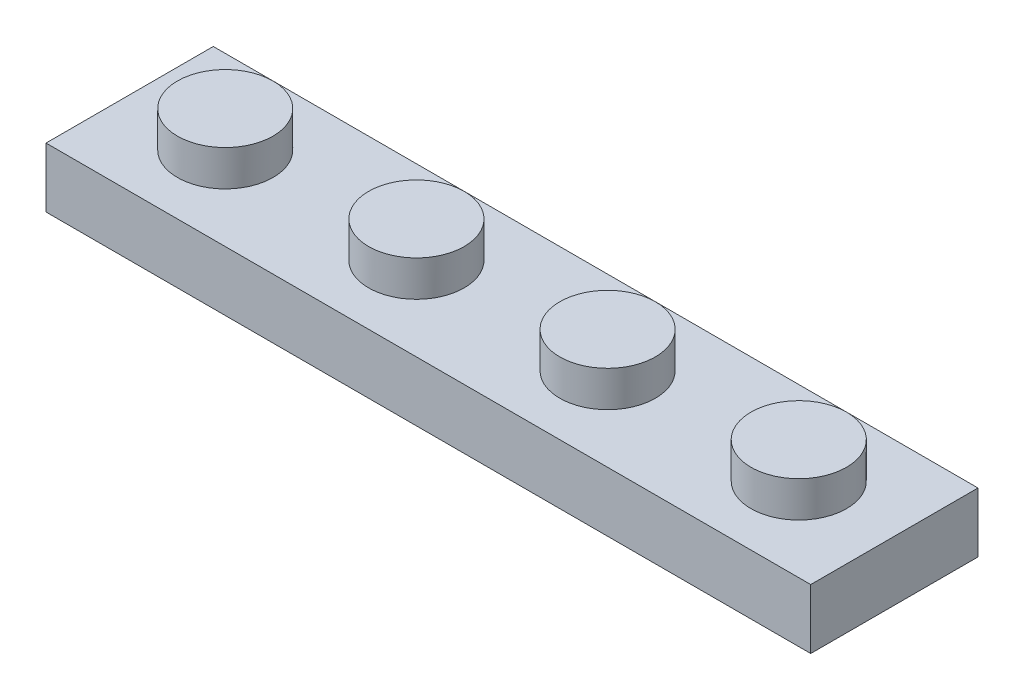
ISO-10303-21;
HEADER;
FILE_DESCRIPTION(('STEP AP214'),'2;1');
FILE_NAME('part.step','',(''),(''),'','','');
FILE_SCHEMA(('AUTOMOTIVE_DESIGN { 1 0 10303 214 1 1 1 1 }'));
ENDSEC;
DATA;
#1=APPLICATION_CONTEXT('core data for automotive mechanical design processes');
#2=APPLICATION_PROTOCOL_DEFINITION('international standard','automotive_design',2000,#1);
#3=PRODUCT_CONTEXT('',#1,'mechanical');
#4=PRODUCT('Part','Part','',(#3));
#5=PRODUCT_RELATED_PRODUCT_CATEGORY('part','',(#4));
#6=PRODUCT_DEFINITION_FORMATION('','',#4);
#7=PRODUCT_DEFINITION_CONTEXT('part definition',#1,'design');
#8=PRODUCT_DEFINITION('design','',#6,#7);
#9=PRODUCT_DEFINITION_SHAPE('','',#8);
#10=(LENGTH_UNIT() NAMED_UNIT(*) SI_UNIT(.MILLI.,.METRE.));
#11=(NAMED_UNIT(*) PLANE_ANGLE_UNIT() SI_UNIT($,.RADIAN.));
#12=(NAMED_UNIT(*) SI_UNIT($,.STERADIAN.) SOLID_ANGLE_UNIT());
#13=UNCERTAINTY_MEASURE_WITH_UNIT(LENGTH_MEASURE(1.E-05),#10,'distance_accuracy_value','');
#14=(GEOMETRIC_REPRESENTATION_CONTEXT(3) GLOBAL_UNCERTAINTY_ASSIGNED_CONTEXT((#13)) GLOBAL_UNIT_ASSIGNED_CONTEXT((#10,
#11,#12)) REPRESENTATION_CONTEXT('',''));
#15=CARTESIAN_POINT('',(0.,0.,0.));
#16=DIRECTION('',(0.,0.,1.));
#17=DIRECTION('',(1.,0.,0.));
#18=AXIS2_PLACEMENT_3D('',#15,#16,#17);
#19=CARTESIAN_POINT('',(-20.32,-3.175,4.445));
#20=DIRECTION('',(1.,0.,0.));
#21=DIRECTION('',(0.,0.,-1.));
#22=AXIS2_PLACEMENT_3D('',#19,#20,#21);
#23=PLANE('',#22);
#24=DIRECTION('',(0.,-1.,0.));
#25=VECTOR('',#24,1.);
#26=CARTESIAN_POINT('',(-20.32,-3.175,-4.445));
#27=LINE('',#26,#25);
#28=CARTESIAN_POINT('',(-20.32,0.,-4.445));
#29=VERTEX_POINT('',#28);
#30=CARTESIAN_POINT('',(-20.32,-3.175,-4.445));
#31=VERTEX_POINT('',#30);
#32=EDGE_CURVE('E163',#29,#31,#27,.T.);
#33=ORIENTED_EDGE('',*,*,#32,.T.);
#34=DIRECTION('',(0.,0.,-1.));
#35=VECTOR('',#34,1.);
#36=CARTESIAN_POINT('',(-20.32,-3.175,4.445));
#37=LINE('',#36,#35);
#38=CARTESIAN_POINT('',(-20.32,-3.175,4.445));
#39=VERTEX_POINT('',#38);
#40=EDGE_CURVE('E184',#39,#31,#37,.T.);
#41=ORIENTED_EDGE('',*,*,#40,.F.);
#42=DIRECTION('',(0.,-1.,0.));
#43=VECTOR('',#42,1.);
#44=CARTESIAN_POINT('',(-20.32,-3.175,4.445));
#45=LINE('',#44,#43);
#46=CARTESIAN_POINT('',(-20.32,0.,4.445));
#47=VERTEX_POINT('',#46);
#48=EDGE_CURVE('E164',#47,#39,#45,.T.);
#49=ORIENTED_EDGE('',*,*,#48,.F.);
#50=DIRECTION('',(0.,0.,-1.));
#51=VECTOR('',#50,1.);
#52=CARTESIAN_POINT('',(-20.32,0.,4.445));
#53=LINE('',#52,#51);
#54=EDGE_CURVE('E170',#47,#29,#53,.T.);
#55=ORIENTED_EDGE('',*,*,#54,.T.);
#56=EDGE_LOOP('',(#33,#41,#49,#55));
#57=FACE_BOUND('',#56,.T.);
#58=ADVANCED_FACE('F35',(#57),#23,.F.);
#59=CARTESIAN_POINT('',(20.32,-3.175,4.445));
#60=DIRECTION('',(0.,1.,0.));
#61=DIRECTION('',(0.,0.,1.));
#62=AXIS2_PLACEMENT_3D('',#59,#60,#61);
#63=PLANE('',#62);
#64=DIRECTION('',(0.,0.,-1.));
#65=VECTOR('',#64,1.);
#66=CARTESIAN_POINT('',(-19.05,-3.175,2.54));
#67=LINE('',#66,#65);
#68=CARTESIAN_POINT('',(-19.05,-3.175,2.54));
#69=VERTEX_POINT('',#68);
#70=CARTESIAN_POINT('',(-19.05,-3.175,-2.54));
#71=VERTEX_POINT('',#70);
#72=EDGE_CURVE('E141',#69,#71,#67,.T.);
#73=ORIENTED_EDGE('',*,*,#72,.F.);
#74=DIRECTION('',(-1.,0.,0.));
#75=VECTOR('',#74,1.);
#76=CARTESIAN_POINT('',(19.05,-3.175,2.54));
#77=LINE('',#76,#75);
#78=CARTESIAN_POINT('',(19.05,-3.175,2.54));
#79=VERTEX_POINT('',#78);
#80=EDGE_CURVE('E49',#79,#69,#77,.T.);
#81=ORIENTED_EDGE('',*,*,#80,.F.);
#82=DIRECTION('',(0.,0.,1.));
#83=VECTOR('',#82,1.);
#84=CARTESIAN_POINT('',(19.05,-3.175,-2.54));
#85=LINE('',#84,#83);
#86=CARTESIAN_POINT('',(19.05,-3.175,-2.54));
#87=VERTEX_POINT('',#86);
#88=EDGE_CURVE('E129',#87,#79,#85,.T.);
#89=ORIENTED_EDGE('',*,*,#88,.F.);
#90=DIRECTION('',(1.,0.,0.));
#91=VECTOR('',#90,1.);
#92=CARTESIAN_POINT('',(-19.05,-3.175,-2.54));
#93=LINE('',#92,#91);
#94=EDGE_CURVE('E132',#71,#87,#93,.T.);
#95=ORIENTED_EDGE('',*,*,#94,.F.);
#96=EDGE_LOOP('',(#73,#81,#89,#95));
#97=FACE_BOUND('',#96,.T.);
#98=DIRECTION('',(1.,0.,0.));
#99=VECTOR('',#98,1.);
#100=CARTESIAN_POINT('',(20.32,-3.175,-4.445));
#101=LINE('',#100,#99);
#102=CARTESIAN_POINT('',(20.32,-3.175,-4.445));
#103=VERTEX_POINT('',#102);
#104=EDGE_CURVE('E173',#31,#103,#101,.T.);
#105=ORIENTED_EDGE('',*,*,#104,.T.);
#106=DIRECTION('',(0.,0.,-1.));
#107=VECTOR('',#106,1.);
#108=CARTESIAN_POINT('',(20.32,-3.175,4.445));
#109=LINE('',#108,#107);
#110=CARTESIAN_POINT('',(20.32,-3.175,4.445));
#111=VERTEX_POINT('',#110);
#112=EDGE_CURVE('E181',#111,#103,#109,.T.);
#113=ORIENTED_EDGE('',*,*,#112,.F.);
#114=DIRECTION('',(1.,0.,0.));
#115=VECTOR('',#114,1.);
#116=CARTESIAN_POINT('',(20.32,-3.175,4.445));
#117=LINE('',#116,#115);
#118=EDGE_CURVE('E87',#39,#111,#117,.T.);
#119=ORIENTED_EDGE('',*,*,#118,.F.);
#120=ORIENTED_EDGE('',*,*,#40,.T.);
#121=EDGE_LOOP('',(#105,#113,#119,#120));
#122=FACE_BOUND('',#121,.T.);
#123=ADVANCED_FACE('F231',(#97,#122),#63,.F.);
#124=CARTESIAN_POINT('',(20.32,0.,4.445));
#125=DIRECTION('',(-1.,0.,0.));
#126=DIRECTION('',(0.,0.,1.));
#127=AXIS2_PLACEMENT_3D('',#124,#125,#126);
#128=PLANE('',#127);
#129=DIRECTION('',(0.,1.,0.));
#130=VECTOR('',#129,1.);
#131=CARTESIAN_POINT('',(20.32,0.,-4.445));
#132=LINE('',#131,#130);
#133=CARTESIAN_POINT('',(20.32,0.,-4.445));
#134=VERTEX_POINT('',#133);
#135=EDGE_CURVE('E175',#103,#134,#132,.T.);
#136=ORIENTED_EDGE('',*,*,#135,.T.);
#137=DIRECTION('',(0.,0.,-1.));
#138=VECTOR('',#137,1.);
#139=CARTESIAN_POINT('',(20.32,0.,4.445));
#140=LINE('',#139,#138);
#141=CARTESIAN_POINT('',(20.32,0.,4.445));
#142=VERTEX_POINT('',#141);
#143=EDGE_CURVE('E179',#142,#134,#140,.T.);
#144=ORIENTED_EDGE('',*,*,#143,.F.);
#145=DIRECTION('',(0.,1.,0.));
#146=VECTOR('',#145,1.);
#147=CARTESIAN_POINT('',(20.32,0.,4.445));
#148=LINE('',#147,#146);
#149=EDGE_CURVE('E167',#111,#142,#148,.T.);
#150=ORIENTED_EDGE('',*,*,#149,.F.);
#151=ORIENTED_EDGE('',*,*,#112,.T.);
#152=EDGE_LOOP('',(#136,#144,#150,#151));
#153=FACE_BOUND('',#152,.T.);
#154=ADVANCED_FACE('F236',(#153),#128,.F.);
#155=CARTESIAN_POINT('',(-20.32,0.,4.445));
#156=DIRECTION('',(0.,-1.,0.));
#157=DIRECTION('',(0.,0.,-1.));
#158=AXIS2_PLACEMENT_3D('',#155,#156,#157);
#159=PLANE('',#158);
#160=CARTESIAN_POINT('',(15.24,0.,0.));
#161=DIRECTION('',(0.,-1.,0.));
#162=DIRECTION('',(0.,0.,-1.));
#163=AXIS2_PLACEMENT_3D('',#160,#161,#162);
#164=CIRCLE('',#163,2.54);
#165=CARTESIAN_POINT('',(15.24,0.,-2.54));
#166=VERTEX_POINT('',#165);
#167=EDGE_CURVE('E195',#166,#166,#164,.F.);
#168=ORIENTED_EDGE('',*,*,#167,.F.);
#169=EDGE_LOOP('',(#168));
#170=FACE_BOUND('',#169,.T.);
#171=CARTESIAN_POINT('',(5.08,0.,0.));
#172=DIRECTION('',(0.,-1.,0.));
#173=DIRECTION('',(0.,0.,-1.));
#174=AXIS2_PLACEMENT_3D('',#171,#172,#173);
#175=CIRCLE('',#174,2.54);
#176=CARTESIAN_POINT('',(5.08,0.,-2.54));
#177=VERTEX_POINT('',#176);
#178=EDGE_CURVE('E192',#177,#177,#175,.F.);
#179=ORIENTED_EDGE('',*,*,#178,.F.);
#180=EDGE_LOOP('',(#179));
#181=FACE_BOUND('',#180,.T.);
#182=CARTESIAN_POINT('',(-5.08,0.,0.));
#183=DIRECTION('',(0.,-1.,0.));
#184=DIRECTION('',(0.,0.,-1.));
#185=AXIS2_PLACEMENT_3D('',#182,#183,#184);
#186=CIRCLE('',#185,2.54);
#187=CARTESIAN_POINT('',(-5.08,0.,-2.54));
#188=VERTEX_POINT('',#187);
#189=EDGE_CURVE('E189',#188,#188,#186,.F.);
#190=ORIENTED_EDGE('',*,*,#189,.F.);
#191=EDGE_LOOP('',(#190));
#192=FACE_BOUND('',#191,.T.);
#193=CARTESIAN_POINT('',(-15.24,0.,0.));
#194=DIRECTION('',(0.,-1.,0.));
#195=DIRECTION('',(0.,0.,-1.));
#196=AXIS2_PLACEMENT_3D('',#193,#194,#195);
#197=CIRCLE('',#196,2.54);
#198=CARTESIAN_POINT('',(-15.24,0.,-2.54));
#199=VERTEX_POINT('',#198);
#200=EDGE_CURVE('E186',#199,#199,#197,.F.);
#201=ORIENTED_EDGE('',*,*,#200,.F.);
#202=EDGE_LOOP('',(#201));
#203=FACE_BOUND('',#202,.T.);
#204=DIRECTION('',(-1.,0.,0.));
#205=VECTOR('',#204,1.);
#206=CARTESIAN_POINT('',(-20.32,0.,-4.445));
#207=LINE('',#206,#205);
#208=EDGE_CURVE('E79',#134,#29,#207,.T.);
#209=ORIENTED_EDGE('',*,*,#208,.T.);
#210=ORIENTED_EDGE('',*,*,#54,.F.);
#211=DIRECTION('',(-1.,0.,0.));
#212=VECTOR('',#211,1.);
#213=CARTESIAN_POINT('',(-20.32,0.,4.445));
#214=LINE('',#213,#212);
#215=EDGE_CURVE('E58',#142,#47,#214,.T.);
#216=ORIENTED_EDGE('',*,*,#215,.F.);
#217=ORIENTED_EDGE('',*,*,#143,.T.);
#218=EDGE_LOOP('',(#209,#210,#216,#217));
#219=FACE_BOUND('',#218,.T.);
#220=ADVANCED_FACE('F249',(#170,#181,#192,#203,#219),#159,.F.);
#221=CARTESIAN_POINT('',(0.,0.,4.445));
#222=DIRECTION('',(0.,0.,-1.));
#223=DIRECTION('',(-1.,0.,0.));
#224=AXIS2_PLACEMENT_3D('',#221,#222,#223);
#225=PLANE('',#224);
#226=ORIENTED_EDGE('',*,*,#48,.T.);
#227=ORIENTED_EDGE('',*,*,#118,.T.);
#228=ORIENTED_EDGE('',*,*,#149,.T.);
#229=ORIENTED_EDGE('',*,*,#215,.T.);
#230=EDGE_LOOP('',(#226,#227,#228,#229));
#231=FACE_BOUND('',#230,.T.);
#232=ADVANCED_FACE('F247',(#231),#225,.F.);
#233=CARTESIAN_POINT('',(0.,0.,-4.445));
#234=DIRECTION('',(0.,0.,-1.));
#235=DIRECTION('',(-1.,0.,0.));
#236=AXIS2_PLACEMENT_3D('',#233,#234,#235);
#237=PLANE('',#236);
#238=ORIENTED_EDGE('',*,*,#32,.F.);
#239=ORIENTED_EDGE('',*,*,#208,.F.);
#240=ORIENTED_EDGE('',*,*,#135,.F.);
#241=ORIENTED_EDGE('',*,*,#104,.F.);
#242=EDGE_LOOP('',(#238,#239,#240,#241));
#243=FACE_BOUND('',#242,.T.);
#244=ADVANCED_FACE('F242',(#243),#237,.T.);
#245=CARTESIAN_POINT('',(-15.24,1.905,0.));
#246=DIRECTION('',(0.,-1.,0.));
#247=DIRECTION('',(0.,0.,-1.));
#248=AXIS2_PLACEMENT_3D('',#245,#246,#247);
#249=CYLINDRICAL_SURFACE('',#248,2.54);
#250=CARTESIAN_POINT('',(-15.24,1.905,0.));
#251=DIRECTION('',(0.,1.,0.));
#252=DIRECTION('',(0.,0.,1.));
#253=AXIS2_PLACEMENT_3D('',#250,#251,#252);
#254=CIRCLE('',#253,2.54);
#255=CARTESIAN_POINT('',(-15.24,1.905,2.54));
#256=VERTEX_POINT('',#255);
#257=EDGE_CURVE('E160',#256,#256,#254,.T.);
#258=ORIENTED_EDGE('',*,*,#257,.F.);
#259=EDGE_LOOP('',(#258));
#260=FACE_BOUND('',#259,.T.);
#261=ORIENTED_EDGE('',*,*,#200,.T.);
#262=EDGE_LOOP('',(#261));
#263=FACE_BOUND('',#262,.T.);
#264=ADVANCED_FACE('F255',(#260,#263),#249,.T.);
#265=CARTESIAN_POINT('',(-15.24,1.905,0.));
#266=DIRECTION('',(0.,1.,0.));
#267=DIRECTION('',(0.,0.,1.));
#268=AXIS2_PLACEMENT_3D('',#265,#266,#267);
#269=PLANE('',#268);
#270=ORIENTED_EDGE('',*,*,#257,.T.);
#271=EDGE_LOOP('',(#270));
#272=FACE_BOUND('',#271,.T.);
#273=ADVANCED_FACE('F284',(#272),#269,.T.);
#274=CARTESIAN_POINT('',(-5.08,1.905,0.));
#275=DIRECTION('',(0.,-1.,0.));
#276=DIRECTION('',(0.,0.,-1.));
#277=AXIS2_PLACEMENT_3D('',#274,#275,#276);
#278=CYLINDRICAL_SURFACE('',#277,2.54);
#279=CARTESIAN_POINT('',(-5.08,1.905,0.));
#280=DIRECTION('',(0.,1.,0.));
#281=DIRECTION('',(0.,0.,1.));
#282=AXIS2_PLACEMENT_3D('',#279,#280,#281);
#283=CIRCLE('',#282,2.54);
#284=CARTESIAN_POINT('',(-5.08,1.905,2.54));
#285=VERTEX_POINT('',#284);
#286=EDGE_CURVE('E157',#285,#285,#283,.T.);
#287=ORIENTED_EDGE('',*,*,#286,.F.);
#288=EDGE_LOOP('',(#287));
#289=FACE_BOUND('',#288,.T.);
#290=ORIENTED_EDGE('',*,*,#189,.T.);
#291=EDGE_LOOP('',(#290));
#292=FACE_BOUND('',#291,.T.);
#293=ADVANCED_FACE('F293',(#289,#292),#278,.T.);
#294=CARTESIAN_POINT('',(-5.08,1.905,0.));
#295=DIRECTION('',(0.,1.,0.));
#296=DIRECTION('',(0.,0.,1.));
#297=AXIS2_PLACEMENT_3D('',#294,#295,#296);
#298=PLANE('',#297);
#299=ORIENTED_EDGE('',*,*,#286,.T.);
#300=EDGE_LOOP('',(#299));
#301=FACE_BOUND('',#300,.T.);
#302=ADVANCED_FACE('F302',(#301),#298,.T.);
#303=CARTESIAN_POINT('',(5.08,1.905,0.));
#304=DIRECTION('',(0.,-1.,0.));
#305=DIRECTION('',(0.,0.,-1.));
#306=AXIS2_PLACEMENT_3D('',#303,#304,#305);
#307=CYLINDRICAL_SURFACE('',#306,2.54);
#308=CARTESIAN_POINT('',(5.08,1.905,0.));
#309=DIRECTION('',(0.,1.,0.));
#310=DIRECTION('',(0.,0.,-1.));
#311=AXIS2_PLACEMENT_3D('',#308,#309,#310);
#312=CIRCLE('',#311,2.54);
#313=CARTESIAN_POINT('',(5.08,1.905,-2.54));
#314=VERTEX_POINT('',#313);
#315=EDGE_CURVE('E154',#314,#314,#312,.T.);
#316=ORIENTED_EDGE('',*,*,#315,.F.);
#317=EDGE_LOOP('',(#316));
#318=FACE_BOUND('',#317,.T.);
#319=ORIENTED_EDGE('',*,*,#178,.T.);
#320=EDGE_LOOP('',(#319));
#321=FACE_BOUND('',#320,.T.);
#322=ADVANCED_FACE('F312',(#318,#321),#307,.T.);
#323=CARTESIAN_POINT('',(5.08,1.905,0.));
#324=DIRECTION('',(0.,-1.,0.));
#325=DIRECTION('',(0.,0.,-1.));
#326=AXIS2_PLACEMENT_3D('',#323,#324,#325);
#327=PLANE('',#326);
#328=ORIENTED_EDGE('',*,*,#315,.T.);
#329=EDGE_LOOP('',(#328));
#330=FACE_BOUND('',#329,.T.);
#331=ADVANCED_FACE('F322',(#330),#327,.F.);
#332=CARTESIAN_POINT('',(15.24,1.905,0.));
#333=DIRECTION('',(0.,-1.,0.));
#334=DIRECTION('',(0.,0.,-1.));
#335=AXIS2_PLACEMENT_3D('',#332,#333,#334);
#336=CYLINDRICAL_SURFACE('',#335,2.54);
#337=CARTESIAN_POINT('',(15.24,1.905,0.));
#338=DIRECTION('',(0.,1.,0.));
#339=DIRECTION('',(0.,0.,-1.));
#340=AXIS2_PLACEMENT_3D('',#337,#338,#339);
#341=CIRCLE('',#340,2.54);
#342=CARTESIAN_POINT('',(15.24,1.905,-2.54));
#343=VERTEX_POINT('',#342);
#344=EDGE_CURVE('E148',#343,#343,#341,.T.);
#345=ORIENTED_EDGE('',*,*,#344,.F.);
#346=EDGE_LOOP('',(#345));
#347=FACE_BOUND('',#346,.T.);
#348=ORIENTED_EDGE('',*,*,#167,.T.);
#349=EDGE_LOOP('',(#348));
#350=FACE_BOUND('',#349,.T.);
#351=ADVANCED_FACE('F332',(#347,#350),#336,.T.);
#352=CARTESIAN_POINT('',(15.24,1.905,0.));
#353=DIRECTION('',(0.,-1.,0.));
#354=DIRECTION('',(0.,0.,-1.));
#355=AXIS2_PLACEMENT_3D('',#352,#353,#354);
#356=PLANE('',#355);
#357=ORIENTED_EDGE('',*,*,#344,.T.);
#358=EDGE_LOOP('',(#357));
#359=FACE_BOUND('',#358,.T.);
#360=ADVANCED_FACE('F342',(#359),#356,.F.);
#361=CARTESIAN_POINT('',(19.05,-1.27,2.54));
#362=DIRECTION('',(0.,0.,1.));
#363=DIRECTION('',(1.,0.,0.));
#364=AXIS2_PLACEMENT_3D('',#361,#362,#363);
#365=PLANE('',#364);
#366=ORIENTED_EDGE('',*,*,#80,.T.);
#367=DIRECTION('',(0.,-1.,0.));
#368=VECTOR('',#367,1.);
#369=CARTESIAN_POINT('',(-19.05,-1.27,2.54));
#370=LINE('',#369,#368);
#371=CARTESIAN_POINT('',(-19.05,-1.27,2.54));
#372=VERTEX_POINT('',#371);
#373=EDGE_CURVE('E107',#372,#69,#370,.T.);
#374=ORIENTED_EDGE('',*,*,#373,.F.);
#375=DIRECTION('',(-1.,0.,0.));
#376=VECTOR('',#375,1.);
#377=CARTESIAN_POINT('',(19.05,-1.27,2.54));
#378=LINE('',#377,#376);
#379=CARTESIAN_POINT('',(19.05,-1.27,2.54));
#380=VERTEX_POINT('',#379);
#381=EDGE_CURVE('E111',#380,#372,#378,.T.);
#382=ORIENTED_EDGE('',*,*,#381,.F.);
#383=DIRECTION('',(0.,-1.,0.));
#384=VECTOR('',#383,1.);
#385=CARTESIAN_POINT('',(19.05,-1.27,2.54));
#386=LINE('',#385,#384);
#387=EDGE_CURVE('E146',#380,#79,#386,.T.);
#388=ORIENTED_EDGE('',*,*,#387,.T.);
#389=EDGE_LOOP('',(#366,#374,#382,#388));
#390=FACE_BOUND('',#389,.T.);
#391=ADVANCED_FACE('F109',(#390),#365,.F.);
#392=CARTESIAN_POINT('',(19.05,-1.27,-2.54));
#393=DIRECTION('',(1.,0.,0.));
#394=DIRECTION('',(0.,0.,-1.));
#395=AXIS2_PLACEMENT_3D('',#392,#393,#394);
#396=PLANE('',#395);
#397=ORIENTED_EDGE('',*,*,#88,.T.);
#398=ORIENTED_EDGE('',*,*,#387,.F.);
#399=DIRECTION('',(0.,0.,1.));
#400=VECTOR('',#399,1.);
#401=CARTESIAN_POINT('',(19.05,-1.27,-2.54));
#402=LINE('',#401,#400);
#403=CARTESIAN_POINT('',(19.05,-1.27,-2.54));
#404=VERTEX_POINT('',#403);
#405=EDGE_CURVE('E117',#404,#380,#402,.T.);
#406=ORIENTED_EDGE('',*,*,#405,.F.);
#407=DIRECTION('',(0.,-1.,0.));
#408=VECTOR('',#407,1.);
#409=CARTESIAN_POINT('',(19.05,-1.27,-2.54));
#410=LINE('',#409,#408);
#411=EDGE_CURVE('E149',#404,#87,#410,.T.);
#412=ORIENTED_EDGE('',*,*,#411,.T.);
#413=EDGE_LOOP('',(#397,#398,#406,#412));
#414=FACE_BOUND('',#413,.T.);
#415=ADVANCED_FACE('F366',(#414),#396,.F.);
#416=CARTESIAN_POINT('',(-19.05,-1.27,-2.54));
#417=DIRECTION('',(0.,0.,-1.));
#418=DIRECTION('',(-1.,0.,0.));
#419=AXIS2_PLACEMENT_3D('',#416,#417,#418);
#420=PLANE('',#419);
#421=ORIENTED_EDGE('',*,*,#94,.T.);
#422=ORIENTED_EDGE('',*,*,#411,.F.);
#423=DIRECTION('',(1.,0.,0.));
#424=VECTOR('',#423,1.);
#425=CARTESIAN_POINT('',(-19.05,-1.27,-2.54));
#426=LINE('',#425,#424);
#427=CARTESIAN_POINT('',(-19.05,-1.27,-2.54));
#428=VERTEX_POINT('',#427);
#429=EDGE_CURVE('E125',#428,#404,#426,.T.);
#430=ORIENTED_EDGE('',*,*,#429,.F.);
#431=DIRECTION('',(0.,-1.,0.));
#432=VECTOR('',#431,1.);
#433=CARTESIAN_POINT('',(-19.05,-1.27,-2.54));
#434=LINE('',#433,#432);
#435=EDGE_CURVE('E116',#428,#71,#434,.T.);
#436=ORIENTED_EDGE('',*,*,#435,.T.);
#437=EDGE_LOOP('',(#421,#422,#430,#436));
#438=FACE_BOUND('',#437,.T.);
#439=ADVANCED_FACE('F375',(#438),#420,.F.);
#440=CARTESIAN_POINT('',(-19.05,-1.27,2.54));
#441=DIRECTION('',(-1.,0.,0.));
#442=DIRECTION('',(0.,0.,1.));
#443=AXIS2_PLACEMENT_3D('',#440,#441,#442);
#444=PLANE('',#443);
#445=ORIENTED_EDGE('',*,*,#72,.T.);
#446=ORIENTED_EDGE('',*,*,#435,.F.);
#447=DIRECTION('',(0.,0.,-1.));
#448=VECTOR('',#447,1.);
#449=CARTESIAN_POINT('',(-19.05,-1.27,2.54));
#450=LINE('',#449,#448);
#451=EDGE_CURVE('E120',#372,#428,#450,.T.);
#452=ORIENTED_EDGE('',*,*,#451,.F.);
#453=ORIENTED_EDGE('',*,*,#373,.T.);
#454=EDGE_LOOP('',(#445,#446,#452,#453));
#455=FACE_BOUND('',#454,.T.);
#456=ADVANCED_FACE('F121',(#455),#444,.F.);
#457=CARTESIAN_POINT('',(0.,-1.27,0.));
#458=DIRECTION('',(0.,-1.,0.));
#459=DIRECTION('',(0.,0.,-1.));
#460=AXIS2_PLACEMENT_3D('',#457,#458,#459);
#461=PLANE('',#460);
#462=CARTESIAN_POINT('',(0.,-1.27,0.));
#463=DIRECTION('',(0.,-1.,0.));
#464=DIRECTION('',(0.,0.,1.));
#465=AXIS2_PLACEMENT_3D('',#462,#463,#464);
#466=CIRCLE('',#465,1.905);
#467=CARTESIAN_POINT('',(0.,-1.27,1.905));
#468=VERTEX_POINT('',#467);
#469=EDGE_CURVE('E583',#468,#468,#466,.T.);
#470=ORIENTED_EDGE('',*,*,#469,.F.);
#471=EDGE_LOOP('',(#470));
#472=FACE_BOUND('',#471,.T.);
#473=CARTESIAN_POINT('',(10.16,-1.27,0.));
#474=DIRECTION('',(0.,-1.,0.));
#475=DIRECTION('',(0.,0.,1.));
#476=AXIS2_PLACEMENT_3D('',#473,#474,#475);
#477=CIRCLE('',#476,1.905);
#478=CARTESIAN_POINT('',(10.16,-1.27,1.905));
#479=VERTEX_POINT('',#478);
#480=EDGE_CURVE('E590',#479,#479,#477,.T.);
#481=ORIENTED_EDGE('',*,*,#480,.F.);
#482=EDGE_LOOP('',(#481));
#483=FACE_BOUND('',#482,.T.);
#484=CARTESIAN_POINT('',(-10.16,-1.27,0.));
#485=DIRECTION('',(0.,-1.,0.));
#486=DIRECTION('',(0.,0.,-1.));
#487=AXIS2_PLACEMENT_3D('',#484,#485,#486);
#488=CIRCLE('',#487,1.905);
#489=CARTESIAN_POINT('',(-10.16,-1.27,-1.905));
#490=VERTEX_POINT('',#489);
#491=EDGE_CURVE('E599',#490,#490,#488,.T.);
#492=ORIENTED_EDGE('',*,*,#491,.F.);
#493=EDGE_LOOP('',(#492));
#494=FACE_BOUND('',#493,.T.);
#495=CARTESIAN_POINT('',(-15.24,-1.27,0.));
#496=DIRECTION('',(0.,-1.,0.));
#497=DIRECTION('',(0.,0.,-1.));
#498=AXIS2_PLACEMENT_3D('',#495,#496,#497);
#499=CIRCLE('',#498,1.905);
#500=CARTESIAN_POINT('',(-15.24,-1.27,-1.905));
#501=VERTEX_POINT('',#500);
#502=EDGE_CURVE('E609',#501,#501,#499,.T.);
#503=ORIENTED_EDGE('',*,*,#502,.F.);
#504=EDGE_LOOP('',(#503));
#505=FACE_BOUND('',#504,.T.);
#506=CARTESIAN_POINT('',(-5.08,-1.27,0.));
#507=DIRECTION('',(0.,-1.,0.));
#508=DIRECTION('',(0.,0.,-1.));
#509=AXIS2_PLACEMENT_3D('',#506,#507,#508);
#510=CIRCLE('',#509,1.905);
#511=CARTESIAN_POINT('',(-5.08,-1.27,-1.905));
#512=VERTEX_POINT('',#511);
#513=EDGE_CURVE('E615',#512,#512,#510,.T.);
#514=ORIENTED_EDGE('',*,*,#513,.F.);
#515=EDGE_LOOP('',(#514));
#516=FACE_BOUND('',#515,.T.);
#517=CARTESIAN_POINT('',(5.08,-1.27,0.));
#518=DIRECTION('',(0.,-1.,0.));
#519=DIRECTION('',(0.,0.,1.));
#520=AXIS2_PLACEMENT_3D('',#517,#518,#519);
#521=CIRCLE('',#520,1.905);
#522=CARTESIAN_POINT('',(5.08,-1.27,1.905));
#523=VERTEX_POINT('',#522);
#524=EDGE_CURVE('E621',#523,#523,#521,.T.);
#525=ORIENTED_EDGE('',*,*,#524,.F.);
#526=EDGE_LOOP('',(#525));
#527=FACE_BOUND('',#526,.T.);
#528=CARTESIAN_POINT('',(15.24,-1.27,0.));
#529=DIRECTION('',(0.,-1.,0.));
#530=DIRECTION('',(0.,0.,1.));
#531=AXIS2_PLACEMENT_3D('',#528,#529,#530);
#532=CIRCLE('',#531,1.905);
#533=CARTESIAN_POINT('',(15.24,-1.27,1.905));
#534=VERTEX_POINT('',#533);
#535=EDGE_CURVE('E135',#534,#534,#532,.T.);
#536=ORIENTED_EDGE('',*,*,#535,.F.);
#537=EDGE_LOOP('',(#536));
#538=FACE_BOUND('',#537,.T.);
#539=ORIENTED_EDGE('',*,*,#381,.T.);
#540=ORIENTED_EDGE('',*,*,#451,.T.);
#541=ORIENTED_EDGE('',*,*,#429,.T.);
#542=ORIENTED_EDGE('',*,*,#405,.T.);
#543=EDGE_LOOP('',(#539,#540,#541,#542));
#544=FACE_BOUND('',#543,.T.);
#545=ADVANCED_FACE('F127',(#472,#483,#494,#505,#516,#527,#538,#544),#461,.T.);
#546=CARTESIAN_POINT('',(15.24,1.27,0.));
#547=DIRECTION('',(0.,-1.,0.));
#548=DIRECTION('',(0.,0.,-1.));
#549=AXIS2_PLACEMENT_3D('',#546,#547,#548);
#550=CYLINDRICAL_SURFACE('',#549,1.905);
#551=CARTESIAN_POINT('',(15.24,1.27,0.));
#552=DIRECTION('',(0.,-1.,0.));
#553=DIRECTION('',(0.,0.,1.));
#554=AXIS2_PLACEMENT_3D('',#551,#552,#553);
#555=CIRCLE('',#554,1.905);
#556=CARTESIAN_POINT('',(15.24,1.27,1.905));
#557=VERTEX_POINT('',#556);
#558=EDGE_CURVE('E623',#557,#557,#555,.T.);
#559=ORIENTED_EDGE('',*,*,#558,.F.);
#560=EDGE_LOOP('',(#559));
#561=FACE_BOUND('',#560,.T.);
#562=ORIENTED_EDGE('',*,*,#535,.T.);
#563=EDGE_LOOP('',(#562));
#564=FACE_BOUND('',#563,.T.);
#565=ADVANCED_FACE('F399',(#561,#564),#550,.F.);
#566=CARTESIAN_POINT('',(15.24,1.27,0.));
#567=DIRECTION('',(0.,1.,0.));
#568=DIRECTION('',(0.,0.,1.));
#569=AXIS2_PLACEMENT_3D('',#566,#567,#568);
#570=PLANE('',#569);
#571=ORIENTED_EDGE('',*,*,#558,.T.);
#572=EDGE_LOOP('',(#571));
#573=FACE_BOUND('',#572,.T.);
#574=ADVANCED_FACE('F404',(#573),#570,.F.);
#575=CARTESIAN_POINT('',(5.08,1.27,0.));
#576=DIRECTION('',(0.,-1.,0.));
#577=DIRECTION('',(0.,0.,-1.));
#578=AXIS2_PLACEMENT_3D('',#575,#576,#577);
#579=CYLINDRICAL_SURFACE('',#578,1.905);
#580=CARTESIAN_POINT('',(5.08,1.27,0.));
#581=DIRECTION('',(0.,-1.,0.));
#582=DIRECTION('',(0.,0.,1.));
#583=AXIS2_PLACEMENT_3D('',#580,#581,#582);
#584=CIRCLE('',#583,1.905);
#585=CARTESIAN_POINT('',(5.08,1.27,1.905));
#586=VERTEX_POINT('',#585);
#587=EDGE_CURVE('E618',#586,#586,#584,.T.);
#588=ORIENTED_EDGE('',*,*,#587,.F.);
#589=EDGE_LOOP('',(#588));
#590=FACE_BOUND('',#589,.T.);
#591=ORIENTED_EDGE('',*,*,#524,.T.);
#592=EDGE_LOOP('',(#591));
#593=FACE_BOUND('',#592,.T.);
#594=ADVANCED_FACE('F413',(#590,#593),#579,.F.);
#595=CARTESIAN_POINT('',(5.08,1.27,0.));
#596=DIRECTION('',(0.,1.,0.));
#597=DIRECTION('',(0.,0.,1.));
#598=AXIS2_PLACEMENT_3D('',#595,#596,#597);
#599=PLANE('',#598);
#600=ORIENTED_EDGE('',*,*,#587,.T.);
#601=EDGE_LOOP('',(#600));
#602=FACE_BOUND('',#601,.T.);
#603=ADVANCED_FACE('F423',(#602),#599,.F.);
#604=CARTESIAN_POINT('',(-5.08,1.27,0.));
#605=DIRECTION('',(0.,-1.,0.));
#606=DIRECTION('',(0.,0.,-1.));
#607=AXIS2_PLACEMENT_3D('',#604,#605,#606);
#608=CYLINDRICAL_SURFACE('',#607,1.905);
#609=CARTESIAN_POINT('',(-5.08,1.27,0.));
#610=DIRECTION('',(0.,-1.,0.));
#611=DIRECTION('',(0.,0.,-1.));
#612=AXIS2_PLACEMENT_3D('',#609,#610,#611);
#613=CIRCLE('',#612,1.905);
#614=CARTESIAN_POINT('',(-5.08,1.27,-1.905));
#615=VERTEX_POINT('',#614);
#616=EDGE_CURVE('E612',#615,#615,#613,.T.);
#617=ORIENTED_EDGE('',*,*,#616,.F.);
#618=EDGE_LOOP('',(#617));
#619=FACE_BOUND('',#618,.T.);
#620=ORIENTED_EDGE('',*,*,#513,.T.);
#621=EDGE_LOOP('',(#620));
#622=FACE_BOUND('',#621,.T.);
#623=ADVANCED_FACE('F433',(#619,#622),#608,.F.);
#624=CARTESIAN_POINT('',(-5.08,1.27,0.));
#625=DIRECTION('',(0.,-1.,0.));
#626=DIRECTION('',(0.,0.,-1.));
#627=AXIS2_PLACEMENT_3D('',#624,#625,#626);
#628=PLANE('',#627);
#629=ORIENTED_EDGE('',*,*,#616,.T.);
#630=EDGE_LOOP('',(#629));
#631=FACE_BOUND('',#630,.T.);
#632=ADVANCED_FACE('F443',(#631),#628,.T.);
#633=CARTESIAN_POINT('',(-15.24,1.27,0.));
#634=DIRECTION('',(0.,-1.,0.));
#635=DIRECTION('',(0.,0.,-1.));
#636=AXIS2_PLACEMENT_3D('',#633,#634,#635);
#637=CYLINDRICAL_SURFACE('',#636,1.905);
#638=CARTESIAN_POINT('',(-15.24,1.27,0.));
#639=DIRECTION('',(0.,-1.,0.));
#640=DIRECTION('',(0.,0.,-1.));
#641=AXIS2_PLACEMENT_3D('',#638,#639,#640);
#642=CIRCLE('',#641,1.905);
#643=CARTESIAN_POINT('',(-15.24,1.27,-1.905));
#644=VERTEX_POINT('',#643);
#645=EDGE_CURVE('E142',#644,#644,#642,.T.);
#646=ORIENTED_EDGE('',*,*,#645,.F.);
#647=EDGE_LOOP('',(#646));
#648=FACE_BOUND('',#647,.T.);
#649=ORIENTED_EDGE('',*,*,#502,.T.);
#650=EDGE_LOOP('',(#649));
#651=FACE_BOUND('',#650,.T.);
#652=ADVANCED_FACE('F453',(#648,#651),#637,.F.);
#653=CARTESIAN_POINT('',(-15.24,1.27,0.));
#654=DIRECTION('',(0.,-1.,0.));
#655=DIRECTION('',(0.,0.,-1.));
#656=AXIS2_PLACEMENT_3D('',#653,#654,#655);
#657=PLANE('',#656);
#658=ORIENTED_EDGE('',*,*,#645,.T.);
#659=EDGE_LOOP('',(#658));
#660=FACE_BOUND('',#659,.T.);
#661=ADVANCED_FACE('F463',(#660),#657,.T.);
#662=CARTESIAN_POINT('',(-10.16,-8.56315367264149,0.));
#663=DIRECTION('',(0.,1.,0.));
#664=DIRECTION('',(0.,0.,1.));
#665=AXIS2_PLACEMENT_3D('',#662,#663,#664);
#666=CYLINDRICAL_SURFACE('',#665,1.905);
#667=CARTESIAN_POINT('',(-10.16,-3.175,0.));
#668=DIRECTION('',(0.,1.,0.));
#669=DIRECTION('',(0.,0.,1.));
#670=AXIS2_PLACEMENT_3D('',#667,#668,#669);
#671=CIRCLE('',#670,1.905);
#672=CARTESIAN_POINT('',(-10.16,-3.175,1.905));
#673=VERTEX_POINT('',#672);
#674=EDGE_CURVE('E598',#673,#673,#671,.T.);
#675=ORIENTED_EDGE('',*,*,#674,.T.);
#676=EDGE_LOOP('',(#675));
#677=FACE_BOUND('',#676,.T.);
#678=ORIENTED_EDGE('',*,*,#491,.T.);
#679=EDGE_LOOP('',(#678));
#680=FACE_BOUND('',#679,.T.);
#681=ADVANCED_FACE('F473',(#677,#680),#666,.T.);
#682=CARTESIAN_POINT('',(-10.16,-8.56315367264149,0.));
#683=DIRECTION('',(0.,1.,0.));
#684=DIRECTION('',(0.,0.,1.));
#685=AXIS2_PLACEMENT_3D('',#682,#683,#684);
#686=CYLINDRICAL_SURFACE('',#685,0.9525);
#687=CARTESIAN_POINT('',(-10.16,-3.175,0.));
#688=DIRECTION('',(0.,1.,0.));
#689=DIRECTION('',(0.,0.,1.));
#690=AXIS2_PLACEMENT_3D('',#687,#688,#689);
#691=CIRCLE('',#690,0.9525);
#692=CARTESIAN_POINT('',(-10.16,-3.175,0.9525));
#693=VERTEX_POINT('',#692);
#694=EDGE_CURVE('E602',#693,#693,#691,.T.);
#695=ORIENTED_EDGE('',*,*,#694,.F.);
#696=EDGE_LOOP('',(#695));
#697=FACE_BOUND('',#696,.T.);
#698=CARTESIAN_POINT('',(-10.16,-1.27,0.));
#699=DIRECTION('',(0.,-1.,0.));
#700=DIRECTION('',(0.,0.,-1.));
#701=AXIS2_PLACEMENT_3D('',#698,#699,#700);
#702=CIRCLE('',#701,0.9525);
#703=CARTESIAN_POINT('',(-10.16,-1.27,-0.9525));
#704=VERTEX_POINT('',#703);
#705=EDGE_CURVE('E198',#704,#704,#702,.F.);
#706=ORIENTED_EDGE('',*,*,#705,.T.);
#707=EDGE_LOOP('',(#706));
#708=FACE_BOUND('',#707,.T.);
#709=ADVANCED_FACE('F490',(#697,#708),#686,.F.);
#710=CARTESIAN_POINT('',(20.32,-3.175,4.445));
#711=DIRECTION('',(0.,1.,0.));
#712=DIRECTION('',(0.,0.,1.));
#713=AXIS2_PLACEMENT_3D('',#710,#711,#712);
#714=PLANE('',#713);
#715=ORIENTED_EDGE('',*,*,#694,.T.);
#716=EDGE_LOOP('',(#715));
#717=FACE_BOUND('',#716,.T.);
#718=ORIENTED_EDGE('',*,*,#674,.F.);
#719=EDGE_LOOP('',(#718));
#720=FACE_BOUND('',#719,.T.);
#721=ADVANCED_FACE('F225',(#717,#720),#714,.F.);
#722=ORIENTED_EDGE('',*,*,#705,.F.);
#723=EDGE_LOOP('',(#722));
#724=FACE_BOUND('',#723,.T.);
#725=ADVANCED_FACE('F210',(#724),#461,.T.);
#726=CARTESIAN_POINT('',(10.16,-8.56315367264149,0.));
#727=DIRECTION('',(0.,1.,0.));
#728=DIRECTION('',(0.,0.,1.));
#729=AXIS2_PLACEMENT_3D('',#726,#727,#728);
#730=CYLINDRICAL_SURFACE('',#729,1.905);
#731=CARTESIAN_POINT('',(10.16,-3.175,0.));
#732=DIRECTION('',(0.,1.,0.));
#733=DIRECTION('',(0.,0.,1.));
#734=AXIS2_PLACEMENT_3D('',#731,#732,#733);
#735=CIRCLE('',#734,1.905);
#736=CARTESIAN_POINT('',(10.16,-3.175,1.905));
#737=VERTEX_POINT('',#736);
#738=EDGE_CURVE('E589',#737,#737,#735,.T.);
#739=ORIENTED_EDGE('',*,*,#738,.T.);
#740=EDGE_LOOP('',(#739));
#741=FACE_BOUND('',#740,.T.);
#742=ORIENTED_EDGE('',*,*,#480,.T.);
#743=EDGE_LOOP('',(#742));
#744=FACE_BOUND('',#743,.T.);
#745=ADVANCED_FACE('F224',(#741,#744),#730,.T.);
#746=CARTESIAN_POINT('',(10.16,-8.56315367264149,0.));
#747=DIRECTION('',(0.,1.,0.));
#748=DIRECTION('',(0.,0.,1.));
#749=AXIS2_PLACEMENT_3D('',#746,#747,#748);
#750=CYLINDRICAL_SURFACE('',#749,0.9525);
#751=CARTESIAN_POINT('',(10.16,-3.175,0.));
#752=DIRECTION('',(0.,1.,0.));
#753=DIRECTION('',(0.,0.,1.));
#754=AXIS2_PLACEMENT_3D('',#751,#752,#753);
#755=CIRCLE('',#754,0.9525);
#756=CARTESIAN_POINT('',(10.16,-3.175,0.9525));
#757=VERTEX_POINT('',#756);
#758=EDGE_CURVE('E593',#757,#757,#755,.T.);
#759=ORIENTED_EDGE('',*,*,#758,.F.);
#760=EDGE_LOOP('',(#759));
#761=FACE_BOUND('',#760,.T.);
#762=CARTESIAN_POINT('',(10.16,-1.27,0.));
#763=DIRECTION('',(0.,-1.,0.));
#764=DIRECTION('',(0.,0.,-1.));
#765=AXIS2_PLACEMENT_3D('',#762,#763,#764);
#766=CIRCLE('',#765,0.9525);
#767=CARTESIAN_POINT('',(10.16,-1.27,-0.9525));
#768=VERTEX_POINT('',#767);
#769=EDGE_CURVE('E42',#768,#768,#766,.F.);
#770=ORIENTED_EDGE('',*,*,#769,.T.);
#771=EDGE_LOOP('',(#770));
#772=FACE_BOUND('',#771,.T.);
#773=ADVANCED_FACE('F203',(#761,#772),#750,.F.);
#774=CARTESIAN_POINT('',(20.32,-3.175,4.445));
#775=DIRECTION('',(0.,1.,0.));
#776=DIRECTION('',(0.,0.,1.));
#777=AXIS2_PLACEMENT_3D('',#774,#775,#776);
#778=PLANE('',#777);
#779=ORIENTED_EDGE('',*,*,#758,.T.);
#780=EDGE_LOOP('',(#779));
#781=FACE_BOUND('',#780,.T.);
#782=ORIENTED_EDGE('',*,*,#738,.F.);
#783=EDGE_LOOP('',(#782));
#784=FACE_BOUND('',#783,.T.);
#785=ADVANCED_FACE('F208',(#781,#784),#778,.F.);
#786=ORIENTED_EDGE('',*,*,#769,.F.);
#787=EDGE_LOOP('',(#786));
#788=FACE_BOUND('',#787,.T.);
#789=ADVANCED_FACE('F205',(#788),#461,.T.);
#790=CARTESIAN_POINT('',(0.,-8.56315367264149,0.));
#791=DIRECTION('',(0.,1.,0.));
#792=DIRECTION('',(0.,0.,1.));
#793=AXIS2_PLACEMENT_3D('',#790,#791,#792);
#794=CYLINDRICAL_SURFACE('',#793,1.905);
#795=CARTESIAN_POINT('',(0.,-3.175,0.));
#796=DIRECTION('',(0.,1.,0.));
#797=DIRECTION('',(0.,0.,1.));
#798=AXIS2_PLACEMENT_3D('',#795,#796,#797);
#799=CIRCLE('',#798,1.905);
#800=CARTESIAN_POINT('',(0.,-3.175,1.905));
#801=VERTEX_POINT('',#800);
#802=EDGE_CURVE('E582',#801,#801,#799,.T.);
#803=ORIENTED_EDGE('',*,*,#802,.T.);
#804=EDGE_LOOP('',(#803));
#805=FACE_BOUND('',#804,.T.);
#806=ORIENTED_EDGE('',*,*,#469,.T.);
#807=EDGE_LOOP('',(#806));
#808=FACE_BOUND('',#807,.T.);
#809=ADVANCED_FACE('F207',(#805,#808),#794,.T.);
#810=CARTESIAN_POINT('',(0.,-8.56315367264149,0.));
#811=DIRECTION('',(0.,1.,0.));
#812=DIRECTION('',(0.,0.,1.));
#813=AXIS2_PLACEMENT_3D('',#810,#811,#812);
#814=CYLINDRICAL_SURFACE('',#813,0.9525);
#815=CARTESIAN_POINT('',(0.,-3.175,0.));
#816=DIRECTION('',(0.,1.,0.));
#817=DIRECTION('',(0.,0.,1.));
#818=AXIS2_PLACEMENT_3D('',#815,#816,#817);
#819=CIRCLE('',#818,0.9525);
#820=CARTESIAN_POINT('',(0.,-3.175,0.9525));
#821=VERTEX_POINT('',#820);
#822=EDGE_CURVE('E579',#821,#821,#819,.T.);
#823=ORIENTED_EDGE('',*,*,#822,.F.);
#824=EDGE_LOOP('',(#823));
#825=FACE_BOUND('',#824,.T.);
#826=CARTESIAN_POINT('',(0.,-1.27,0.));
#827=DIRECTION('',(0.,-1.,0.));
#828=DIRECTION('',(0.,0.,-1.));
#829=AXIS2_PLACEMENT_3D('',#826,#827,#828);
#830=CIRCLE('',#829,0.9525);
#831=CARTESIAN_POINT('',(0.,-1.27,-0.9525));
#832=VERTEX_POINT('',#831);
#833=EDGE_CURVE('E11',#832,#832,#830,.F.);
#834=ORIENTED_EDGE('',*,*,#833,.T.);
#835=EDGE_LOOP('',(#834));
#836=FACE_BOUND('',#835,.T.);
#837=ADVANCED_FACE('F216',(#825,#836),#814,.F.);
#838=CARTESIAN_POINT('',(20.32,-3.175,4.445));
#839=DIRECTION('',(0.,1.,0.));
#840=DIRECTION('',(0.,0.,1.));
#841=AXIS2_PLACEMENT_3D('',#838,#839,#840);
#842=PLANE('',#841);
#843=ORIENTED_EDGE('',*,*,#822,.T.);
#844=EDGE_LOOP('',(#843));
#845=FACE_BOUND('',#844,.T.);
#846=ORIENTED_EDGE('',*,*,#802,.F.);
#847=EDGE_LOOP('',(#846));
#848=FACE_BOUND('',#847,.T.);
#849=ADVANCED_FACE('F228',(#845,#848),#842,.F.);
#850=ORIENTED_EDGE('',*,*,#833,.F.);
#851=EDGE_LOOP('',(#850));
#852=FACE_BOUND('',#851,.T.);
#853=ADVANCED_FACE('F211',(#852),#461,.T.);
#854=CLOSED_SHELL('',(#58,#123,#154,#220,#232,#244,#264,#273,#293,#302,#322,#331,#351,#360,#391,
#415,#439,#456,#545,#565,#574,#594,#603,#623,#632,#652,#661,#681,#709,#721,#725,#745,#773,#785,
#789,#809,#837,#849,#853));
#855=MANIFOLD_SOLID_BREP('B2',#854);
#856=ADVANCED_BREP_SHAPE_REPRESENTATION('',(#18,#855),#14);
#857=SHAPE_DEFINITION_REPRESENTATION(#9,#856);
ENDSEC;
END-ISO-10303-21;
